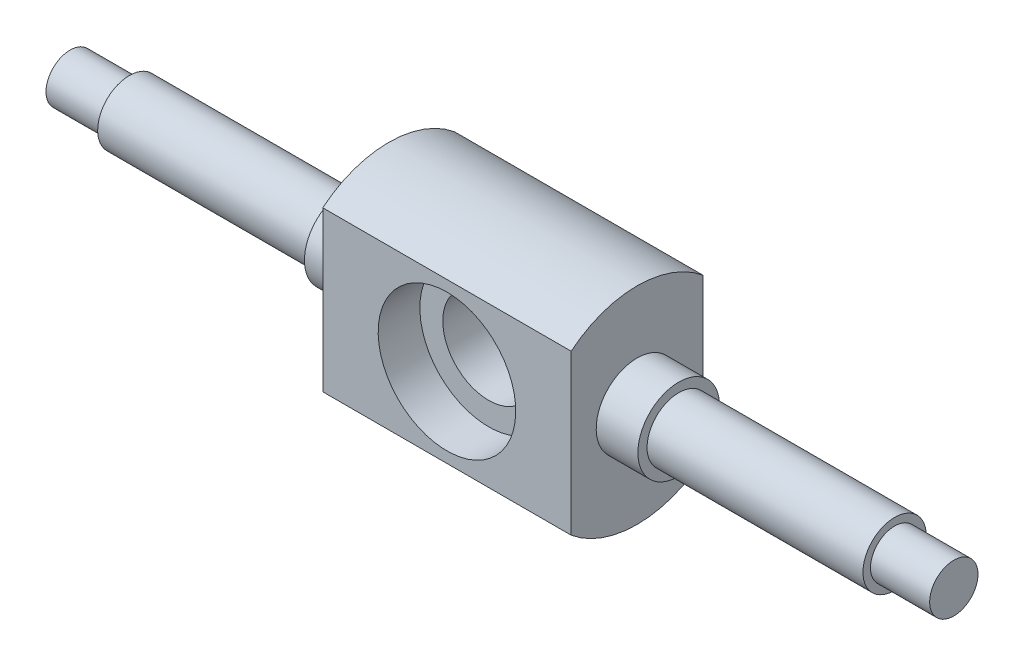
ISO-10303-21;
HEADER;
FILE_DESCRIPTION(('STEP AP214'),'2;1');
FILE_NAME('part.step','',(''),(''),'','','');
FILE_SCHEMA(('AUTOMOTIVE_DESIGN { 1 0 10303 214 1 1 1 1 }'));
ENDSEC;
DATA;
#1=APPLICATION_CONTEXT('core data for automotive mechanical design processes');
#2=APPLICATION_PROTOCOL_DEFINITION('international standard','automotive_design',2000,#1);
#3=PRODUCT_CONTEXT('',#1,'mechanical');
#4=PRODUCT('Part','Part','',(#3));
#5=PRODUCT_RELATED_PRODUCT_CATEGORY('part','',(#4));
#6=PRODUCT_DEFINITION_FORMATION('','',#4);
#7=PRODUCT_DEFINITION_CONTEXT('part definition',#1,'design');
#8=PRODUCT_DEFINITION('design','',#6,#7);
#9=PRODUCT_DEFINITION_SHAPE('','',#8);
#10=(LENGTH_UNIT() NAMED_UNIT(*) SI_UNIT(.MILLI.,.METRE.));
#11=(NAMED_UNIT(*) PLANE_ANGLE_UNIT() SI_UNIT($,.RADIAN.));
#12=(NAMED_UNIT(*) SI_UNIT($,.STERADIAN.) SOLID_ANGLE_UNIT());
#13=UNCERTAINTY_MEASURE_WITH_UNIT(LENGTH_MEASURE(1.E-05),#10,'distance_accuracy_value','');
#14=(GEOMETRIC_REPRESENTATION_CONTEXT(3) GLOBAL_UNCERTAINTY_ASSIGNED_CONTEXT((#13)) GLOBAL_UNIT_ASSIGNED_CONTEXT((#10,
#11,#12)) REPRESENTATION_CONTEXT('',''));
#15=CARTESIAN_POINT('',(0.,0.,0.));
#16=DIRECTION('',(0.,0.,1.));
#17=DIRECTION('',(1.,0.,0.));
#18=AXIS2_PLACEMENT_3D('',#15,#16,#17);
#19=CARTESIAN_POINT('',(7.09966666666639,2.90000004470337,7.8999999999998));
#20=DIRECTION('',(-1.,0.,0.));
#21=DIRECTION('',(0.,-1.,0.));
#22=AXIS2_PLACEMENT_3D('',#19,#20,#21);
#23=PLANE('',#22);
#24=CARTESIAN_POINT('',(7.09966666666639,2.90000004470337,7.8999999999998));
#25=DIRECTION('',(1.,0.,0.));
#26=DIRECTION('',(0.,1.,0.));
#27=AXIS2_PLACEMENT_3D('',#24,#25,#26);
#28=CIRCLE('',#27,3.8);
#29=CARTESIAN_POINT('',(7.09966666666639,6.70000004470339,7.89999999999991));
#30=VERTEX_POINT('',#29);
#31=EDGE_CURVE('E20',#30,#30,#28,.T.);
#32=ORIENTED_EDGE('',*,*,#31,.F.);
#33=EDGE_LOOP('',(#32));
#34=FACE_BOUND('',#33,.T.);
#35=CARTESIAN_POINT('',(7.09966666666639,2.90000004470337,7.8999999999998));
#36=DIRECTION('',(-1.,0.,0.));
#37=DIRECTION('',(0.,-1.,0.));
#38=AXIS2_PLACEMENT_3D('',#35,#36,#37);
#39=CIRCLE('',#38,2.90000004470348);
#40=CARTESIAN_POINT('',(7.09966666666628,0.,7.8999999999998));
#41=VERTEX_POINT('',#40);
#42=EDGE_CURVE('E10',#41,#41,#39,.T.);
#43=ORIENTED_EDGE('',*,*,#42,.F.);
#44=EDGE_LOOP('',(#43));
#45=FACE_BOUND('',#44,.T.);
#46=ADVANCED_FACE('F16',(#34,#45),#23,.T.);
#47=CARTESIAN_POINT('',(106.,2.90000004470337,7.8999999999998));
#48=DIRECTION('',(-1.,0.,0.));
#49=DIRECTION('',(0.,-1.,0.));
#50=AXIS2_PLACEMENT_3D('',#47,#48,#49);
#51=CYLINDRICAL_SURFACE('',#50,2.90000004470348);
#52=ORIENTED_EDGE('',*,*,#42,.T.);
#53=EDGE_LOOP('',(#52));
#54=FACE_BOUND('',#53,.T.);
#55=CARTESIAN_POINT('',(-3.33066907387547E-13,2.90000004470337,7.8999999999998));
#56=DIRECTION('',(-1.,0.,0.));
#57=DIRECTION('',(0.,-1.,0.));
#58=AXIS2_PLACEMENT_3D('',#55,#56,#57);
#59=CIRCLE('',#58,2.90000004470348);
#60=CARTESIAN_POINT('',(-3.33066907387547E-13,0.,7.8999999999998));
#61=VERTEX_POINT('',#60);
#62=EDGE_CURVE('E143',#61,#61,#59,.T.);
#63=ORIENTED_EDGE('',*,*,#62,.F.);
#64=EDGE_LOOP('',(#63));
#65=FACE_BOUND('',#64,.T.);
#66=ADVANCED_FACE('F385',(#54,#65),#51,.T.);
#67=CARTESIAN_POINT('',(106.,2.90000004470337,7.8999999999998));
#68=DIRECTION('',(-1.,0.,0.));
#69=DIRECTION('',(0.,-1.,0.));
#70=AXIS2_PLACEMENT_3D('',#67,#68,#69);
#71=CYLINDRICAL_SURFACE('',#70,2.90000004470348);
#72=CARTESIAN_POINT('',(106.,2.90000004470337,7.8999999999998));
#73=DIRECTION('',(-1.,0.,0.));
#74=DIRECTION('',(0.,-1.,0.));
#75=AXIS2_PLACEMENT_3D('',#72,#73,#74);
#76=CIRCLE('',#75,2.90000004470348);
#77=CARTESIAN_POINT('',(106.,-1.11022302462516E-13,7.8999999999998));
#78=VERTEX_POINT('',#77);
#79=EDGE_CURVE('E133',#78,#78,#76,.T.);
#80=ORIENTED_EDGE('',*,*,#79,.T.);
#81=EDGE_LOOP('',(#80));
#82=FACE_BOUND('',#81,.T.);
#83=CARTESIAN_POINT('',(98.8999999999996,2.90000004470337,7.8999999999998));
#84=DIRECTION('',(1.,0.,0.));
#85=DIRECTION('',(0.,-1.,0.));
#86=AXIS2_PLACEMENT_3D('',#83,#84,#85);
#87=CIRCLE('',#86,2.90000004470348);
#88=CARTESIAN_POINT('',(98.8999999999997,-1.11022302462516E-13,7.89999999999991));
#89=VERTEX_POINT('',#88);
#90=EDGE_CURVE('E27',#89,#89,#87,.T.);
#91=ORIENTED_EDGE('',*,*,#90,.T.);
#92=EDGE_LOOP('',(#91));
#93=FACE_BOUND('',#92,.T.);
#94=ADVANCED_FACE('F379',(#82,#93),#71,.T.);
#95=CARTESIAN_POINT('',(98.8999999999996,2.90000004470337,7.8999999999998));
#96=DIRECTION('',(1.,0.,0.));
#97=DIRECTION('',(0.,0.,1.));
#98=AXIS2_PLACEMENT_3D('',#95,#96,#97);
#99=PLANE('',#98);
#100=CARTESIAN_POINT('',(98.8999999999996,2.90000004470337,7.8999999999998));
#101=DIRECTION('',(-1.,0.,0.));
#102=DIRECTION('',(0.,-1.,0.));
#103=AXIS2_PLACEMENT_3D('',#100,#101,#102);
#104=CIRCLE('',#103,3.8);
#105=CARTESIAN_POINT('',(98.8999999999997,-0.899999955296549,7.89999999999991));
#106=VERTEX_POINT('',#105);
#107=EDGE_CURVE('E182',#106,#106,#104,.T.);
#108=ORIENTED_EDGE('',*,*,#107,.F.);
#109=EDGE_LOOP('',(#108));
#110=FACE_BOUND('',#109,.T.);
#111=ORIENTED_EDGE('',*,*,#90,.F.);
#112=EDGE_LOOP('',(#111));
#113=FACE_BOUND('',#112,.T.);
#114=ADVANCED_FACE('F384',(#110,#113),#99,.T.);
#115=CARTESIAN_POINT('',(-3.33066907387547E-13,2.90000004470337,7.8999999999998));
#116=DIRECTION('',(-1.,0.,0.));
#117=DIRECTION('',(0.,0.,1.));
#118=AXIS2_PLACEMENT_3D('',#115,#116,#117);
#119=PLANE('',#118);
#120=ORIENTED_EDGE('',*,*,#62,.T.);
#121=EDGE_LOOP('',(#120));
#122=FACE_BOUND('',#121,.T.);
#123=ADVANCED_FACE('F409',(#122),#119,.T.);
#124=CARTESIAN_POINT('',(32.9999999999996,2.90000004470337,7.8999999999998));
#125=DIRECTION('',(-1.,0.,0.));
#126=DIRECTION('',(0.,0.,1.));
#127=AXIS2_PLACEMENT_3D('',#124,#125,#126);
#128=PLANE('',#127);
#129=CARTESIAN_POINT('',(32.9999999999996,2.90000004470337,7.8999999999998));
#130=DIRECTION('',(-1.,0.,0.));
#131=DIRECTION('',(0.,0.,-1.));
#132=AXIS2_PLACEMENT_3D('',#129,#130,#131);
#133=CIRCLE('',#132,4.90000007450581);
#134=CARTESIAN_POINT('',(32.9999999999996,2.90000004470337,2.99999992549416));
#135=VERTEX_POINT('',#134);
#136=EDGE_CURVE('E68',#135,#135,#133,.T.);
#137=ORIENTED_EDGE('',*,*,#136,.T.);
#138=EDGE_LOOP('',(#137));
#139=FACE_BOUND('',#138,.T.);
#140=CARTESIAN_POINT('',(32.9999999999996,2.90000004470337,7.8999999999998));
#141=DIRECTION('',(-1.,0.,0.));
#142=DIRECTION('',(0.,0.,-1.));
#143=AXIS2_PLACEMENT_3D('',#140,#141,#142);
#144=CIRCLE('',#143,3.8);
#145=CARTESIAN_POINT('',(32.9999999999996,2.90000004470337,4.09999999999977));
#146=VERTEX_POINT('',#145);
#147=EDGE_CURVE('E180',#146,#146,#144,.T.);
#148=ORIENTED_EDGE('',*,*,#147,.F.);
#149=EDGE_LOOP('',(#148));
#150=FACE_BOUND('',#149,.T.);
#151=ADVANCED_FACE('F414',(#139,#150),#128,.T.);
#152=CARTESIAN_POINT('',(53.0969995708462,2.90000004470337,10.7999999999999));
#153=DIRECTION('',(0.,0.,1.));
#154=DIRECTION('',(0.,1.,0.));
#155=AXIS2_PLACEMENT_3D('',#152,#153,#154);
#156=PLANE('',#155);
#157=CARTESIAN_POINT('',(53.0969995708461,2.90000004470392,10.7999999999999));
#158=DIRECTION('',(0.,0.,-1.));
#159=DIRECTION('',(0.,1.,0.));
#160=AXIS2_PLACEMENT_3D('',#157,#158,#159);
#161=CIRCLE('',#160,8.25);
#162=CARTESIAN_POINT('',(53.0969995708461,11.1500000447039,10.7999999999999));
#163=VERTEX_POINT('',#162);
#164=EDGE_CURVE('E144',#163,#163,#161,.T.);
#165=ORIENTED_EDGE('',*,*,#164,.F.);
#166=EDGE_LOOP('',(#165));
#167=FACE_BOUND('',#166,.T.);
#168=CARTESIAN_POINT('',(53.0969995708461,2.90000004470392,10.7999999999999));
#169=DIRECTION('',(0.,0.,1.));
#170=DIRECTION('',(0.,-1.,0.));
#171=AXIS2_PLACEMENT_3D('',#168,#169,#170);
#172=CIRCLE('',#171,5.50000005960464);
#173=CARTESIAN_POINT('',(53.0969995708461,-2.60000001490079,10.7999999999999));
#174=VERTEX_POINT('',#173);
#175=EDGE_CURVE('E115',#174,#174,#172,.T.);
#176=ORIENTED_EDGE('',*,*,#175,.F.);
#177=EDGE_LOOP('',(#176));
#178=FACE_BOUND('',#177,.T.);
#179=ADVANCED_FACE('F474',(#167,#178),#156,.T.);
#180=CARTESIAN_POINT('',(53.0969995708461,2.90000004470392,4.99999999999989));
#181=DIRECTION('',(0.,0.,-1.));
#182=DIRECTION('',(1.,0.,0.));
#183=AXIS2_PLACEMENT_3D('',#180,#181,#182);
#184=PLANE('',#183);
#185=CARTESIAN_POINT('',(53.0969995708461,2.90000004470392,4.99999999999989));
#186=DIRECTION('',(0.,0.,1.));
#187=DIRECTION('',(1.,0.,0.));
#188=AXIS2_PLACEMENT_3D('',#185,#186,#187);
#189=CIRCLE('',#188,8.25);
#190=CARTESIAN_POINT('',(61.3469995708461,2.90000004470392,4.99999999999989));
#191=VERTEX_POINT('',#190);
#192=EDGE_CURVE('E170',#191,#191,#189,.T.);
#193=ORIENTED_EDGE('',*,*,#192,.F.);
#194=EDGE_LOOP('',(#193));
#195=FACE_BOUND('',#194,.T.);
#196=CARTESIAN_POINT('',(53.0969995708461,2.90000004470392,4.99999999999989));
#197=DIRECTION('',(0.,0.,-1.));
#198=DIRECTION('',(0.,-1.,0.));
#199=AXIS2_PLACEMENT_3D('',#196,#197,#198);
#200=CIRCLE('',#199,5.50000005960464);
#201=CARTESIAN_POINT('',(53.0969995708462,-2.60000001490079,4.99999999999989));
#202=VERTEX_POINT('',#201);
#203=EDGE_CURVE('E123',#202,#202,#200,.T.);
#204=ORIENTED_EDGE('',*,*,#203,.F.);
#205=EDGE_LOOP('',(#204));
#206=FACE_BOUND('',#205,.T.);
#207=ADVANCED_FACE('F444',(#195,#206),#184,.T.);
#208=CARTESIAN_POINT('',(53.0969995708461,2.90000004470392,15.7999999999998));
#209=DIRECTION('',(0.,0.,1.));
#210=DIRECTION('',(0.,1.,0.));
#211=AXIS2_PLACEMENT_3D('',#208,#209,#210);
#212=CYLINDRICAL_SURFACE('',#211,8.25);
#213=CARTESIAN_POINT('',(53.0969995708461,2.90000004470392,15.7999999999998));
#214=DIRECTION('',(0.,0.,-1.));
#215=DIRECTION('',(0.,1.,0.));
#216=AXIS2_PLACEMENT_3D('',#213,#214,#215);
#217=CIRCLE('',#216,8.25);
#218=CARTESIAN_POINT('',(53.0969995708462,11.1500000447039,15.7999999999998));
#219=VERTEX_POINT('',#218);
#220=EDGE_CURVE('E148',#219,#219,#217,.T.);
#221=ORIENTED_EDGE('',*,*,#220,.F.);
#222=EDGE_LOOP('',(#221));
#223=FACE_BOUND('',#222,.T.);
#224=ORIENTED_EDGE('',*,*,#164,.T.);
#225=EDGE_LOOP('',(#224));
#226=FACE_BOUND('',#225,.T.);
#227=ADVANCED_FACE('F439',(#223,#226),#212,.F.);
#228=CARTESIAN_POINT('',(53.0999988853926,2.90000004470337,15.7999999999998));
#229=DIRECTION('',(0.,0.,-1.));
#230=DIRECTION('',(1.,0.,0.));
#231=AXIS2_PLACEMENT_3D('',#228,#229,#230);
#232=PLANE('',#231);
#233=DIRECTION('',(0.,-1.,0.));
#234=VECTOR('',#233,1.);
#235=CARTESIAN_POINT('',(67.9999999999997,2.90000004470337,15.7999999999998));
#236=LINE('',#235,#234);
#237=CARTESIAN_POINT('',(67.9999999999996,12.4577194379479,15.7999999999998));
#238=VERTEX_POINT('',#237);
#239=CARTESIAN_POINT('',(67.9999999999997,-6.65771934854109,15.7999999999998));
#240=VERTEX_POINT('',#239);
#241=EDGE_CURVE('E185',#238,#240,#236,.T.);
#242=ORIENTED_EDGE('',*,*,#241,.F.);
#243=DIRECTION('',(1.,0.,0.));
#244=VECTOR('',#243,1.);
#245=CARTESIAN_POINT('',(73.0999999999996,12.4577194379479,15.7999999999998));
#246=LINE('',#245,#244);
#247=CARTESIAN_POINT('',(38.1999999999997,12.4577194379479,15.7999999999999));
#248=VERTEX_POINT('',#247);
#249=EDGE_CURVE('E174',#248,#238,#246,.T.);
#250=ORIENTED_EDGE('',*,*,#249,.F.);
#251=DIRECTION('',(0.,1.,0.));
#252=VECTOR('',#251,1.);
#253=CARTESIAN_POINT('',(38.1999999999997,2.90000004470337,15.7999999999998));
#254=LINE('',#253,#252);
#255=CARTESIAN_POINT('',(38.1999999999997,-6.65771934854098,15.7999999999998));
#256=VERTEX_POINT('',#255);
#257=EDGE_CURVE('E157',#256,#248,#254,.T.);
#258=ORIENTED_EDGE('',*,*,#257,.F.);
#259=DIRECTION('',(-1.,0.,0.));
#260=VECTOR('',#259,1.);
#261=CARTESIAN_POINT('',(73.0999999999996,-6.65771934854109,15.7999999999998));
#262=LINE('',#261,#260);
#263=EDGE_CURVE('E134',#240,#256,#262,.T.);
#264=ORIENTED_EDGE('',*,*,#263,.F.);
#265=EDGE_LOOP('',(#242,#250,#258,#264));
#266=FACE_BOUND('',#265,.T.);
#267=ORIENTED_EDGE('',*,*,#220,.T.);
#268=EDGE_LOOP('',(#267));
#269=FACE_BOUND('',#268,.T.);
#270=ADVANCED_FACE('F226',(#266,#269),#232,.F.);
#271=CARTESIAN_POINT('',(38.1999999999997,2.90000004470337,7.8999999999998));
#272=DIRECTION('',(-1.,0.,0.));
#273=DIRECTION('',(0.,0.,1.));
#274=AXIS2_PLACEMENT_3D('',#271,#272,#273);
#275=PLANE('',#274);
#276=ORIENTED_EDGE('',*,*,#257,.T.);
#277=CARTESIAN_POINT('',(38.1999999999997,2.90000004470337,7.8999999999998));
#278=DIRECTION('',(1.,0.,0.));
#279=DIRECTION('',(0.,0.693974062915902,0.72));
#280=AXIS2_PLACEMENT_3D('',#277,#278,#279);
#281=CIRCLE('',#280,12.4);
#282=CARTESIAN_POINT('',(38.1999999999997,12.4577194379479,-1.11022302462516E-13));
#283=VERTEX_POINT('',#282);
#284=EDGE_CURVE('E160',#283,#248,#281,.T.);
#285=ORIENTED_EDGE('',*,*,#284,.F.);
#286=DIRECTION('',(0.,-1.,0.));
#287=VECTOR('',#286,1.);
#288=CARTESIAN_POINT('',(38.1999999999996,2.90000004470337,-2.22044604925031E-13));
#289=LINE('',#288,#287);
#290=CARTESIAN_POINT('',(38.1999999999996,-6.65771934854109,-2.22044604925031E-13));
#291=VERTEX_POINT('',#290);
#292=EDGE_CURVE('E189',#283,#291,#289,.T.);
#293=ORIENTED_EDGE('',*,*,#292,.T.);
#294=CARTESIAN_POINT('',(38.1999999999997,2.90000004470337,7.8999999999998));
#295=DIRECTION('',(-1.,0.,0.));
#296=DIRECTION('',(0.,0.,-1.));
#297=AXIS2_PLACEMENT_3D('',#294,#295,#296);
#298=CIRCLE('',#297,12.4);
#299=EDGE_CURVE('E138',#291,#256,#298,.T.);
#300=ORIENTED_EDGE('',*,*,#299,.T.);
#301=EDGE_LOOP('',(#276,#285,#293,#300));
#302=FACE_BOUND('',#301,.T.);
#303=CARTESIAN_POINT('',(38.1999999999997,2.90000004470337,7.8999999999998));
#304=DIRECTION('',(1.,0.,0.));
#305=DIRECTION('',(0.,0.,-1.));
#306=AXIS2_PLACEMENT_3D('',#303,#304,#305);
#307=CIRCLE('',#306,4.90000007450581);
#308=CARTESIAN_POINT('',(38.1999999999997,2.90000004470348,2.99999992549393));
#309=VERTEX_POINT('',#308);
#310=EDGE_CURVE('E81',#309,#309,#307,.T.);
#311=ORIENTED_EDGE('',*,*,#310,.T.);
#312=EDGE_LOOP('',(#311));
#313=FACE_BOUND('',#312,.T.);
#314=ADVANCED_FACE('F368',(#302,#313),#275,.T.);
#315=CARTESIAN_POINT('',(73.0999999999996,2.90000004470348,7.8999999999998));
#316=DIRECTION('',(-1.,0.,0.));
#317=DIRECTION('',(0.,0.693974062915902,0.72));
#318=AXIS2_PLACEMENT_3D('',#315,#316,#317);
#319=CYLINDRICAL_SURFACE('',#318,12.4);
#320=ORIENTED_EDGE('',*,*,#249,.T.);
#321=CARTESIAN_POINT('',(67.9999999999997,2.90000004470337,7.89999999999991));
#322=DIRECTION('',(1.,0.,0.));
#323=DIRECTION('',(0.,0.693974062915902,0.72));
#324=AXIS2_PLACEMENT_3D('',#321,#322,#323);
#325=CIRCLE('',#324,12.4);
#326=CARTESIAN_POINT('',(67.9999999999997,12.4577194379479,-2.22044604925031E-13));
#327=VERTEX_POINT('',#326);
#328=EDGE_CURVE('E151',#327,#238,#325,.T.);
#329=ORIENTED_EDGE('',*,*,#328,.F.);
#330=DIRECTION('',(-1.,0.,0.));
#331=VECTOR('',#330,1.);
#332=CARTESIAN_POINT('',(73.0999999999996,12.4577194379479,-1.11022302462516E-13));
#333=LINE('',#332,#331);
#334=EDGE_CURVE('E175',#327,#283,#333,.T.);
#335=ORIENTED_EDGE('',*,*,#334,.T.);
#336=ORIENTED_EDGE('',*,*,#284,.T.);
#337=EDGE_LOOP('',(#320,#329,#335,#336));
#338=FACE_BOUND('',#337,.T.);
#339=ADVANCED_FACE('F213',(#338),#319,.T.);
#340=CARTESIAN_POINT('',(53.0969995708461,2.90000004470392,15.7999999999998));
#341=DIRECTION('',(0.,0.,1.));
#342=DIRECTION('',(0.,1.,0.));
#343=AXIS2_PLACEMENT_3D('',#340,#341,#342);
#344=CYLINDRICAL_SURFACE('',#343,8.25);
#345=CARTESIAN_POINT('',(53.0969995708461,2.90000004470392,0.));
#346=DIRECTION('',(0.,0.,1.));
#347=DIRECTION('',(1.,0.,0.));
#348=AXIS2_PLACEMENT_3D('',#345,#346,#347);
#349=CIRCLE('',#348,8.25);
#350=CARTESIAN_POINT('',(61.3469995708461,2.90000004470392,-1.11022302462516E-13));
#351=VERTEX_POINT('',#350);
#352=EDGE_CURVE('E155',#351,#351,#349,.T.);
#353=ORIENTED_EDGE('',*,*,#352,.F.);
#354=EDGE_LOOP('',(#353));
#355=FACE_BOUND('',#354,.T.);
#356=ORIENTED_EDGE('',*,*,#192,.T.);
#357=EDGE_LOOP('',(#356));
#358=FACE_BOUND('',#357,.T.);
#359=ADVANCED_FACE('F392',(#355,#358),#344,.F.);
#360=CARTESIAN_POINT('',(53.0999988853927,2.90000004470337,-1.11022302462516E-13));
#361=DIRECTION('',(0.,0.,-1.));
#362=DIRECTION('',(1.,0.,0.));
#363=AXIS2_PLACEMENT_3D('',#360,#361,#362);
#364=PLANE('',#363);
#365=ORIENTED_EDGE('',*,*,#292,.F.);
#366=ORIENTED_EDGE('',*,*,#334,.F.);
#367=DIRECTION('',(0.,1.,0.));
#368=VECTOR('',#367,1.);
#369=CARTESIAN_POINT('',(67.9999999999997,2.90000004470337,-2.22044604925031E-13));
#370=LINE('',#369,#368);
#371=CARTESIAN_POINT('',(67.9999999999996,-6.6577193485412,-2.22044604925031E-13));
#372=VERTEX_POINT('',#371);
#373=EDGE_CURVE('E156',#372,#327,#370,.T.);
#374=ORIENTED_EDGE('',*,*,#373,.F.);
#375=DIRECTION('',(1.,0.,0.));
#376=VECTOR('',#375,1.);
#377=CARTESIAN_POINT('',(73.0999999999996,-6.65771934854109,-1.11022302462516E-13));
#378=LINE('',#377,#376);
#379=EDGE_CURVE('E161',#291,#372,#378,.T.);
#380=ORIENTED_EDGE('',*,*,#379,.F.);
#381=EDGE_LOOP('',(#365,#366,#374,#380));
#382=FACE_BOUND('',#381,.T.);
#383=ORIENTED_EDGE('',*,*,#352,.T.);
#384=EDGE_LOOP('',(#383));
#385=FACE_BOUND('',#384,.T.);
#386=ADVANCED_FACE('F256',(#382,#385),#364,.T.);
#387=CARTESIAN_POINT('',(67.9999999999997,2.90000004470337,7.89999999999991));
#388=DIRECTION('',(-1.,0.,0.));
#389=DIRECTION('',(0.,0.,1.));
#390=AXIS2_PLACEMENT_3D('',#387,#388,#389);
#391=PLANE('',#390);
#392=ORIENTED_EDGE('',*,*,#241,.T.);
#393=CARTESIAN_POINT('',(67.9999999999997,2.90000004470337,7.89999999999991));
#394=DIRECTION('',(-1.,0.,0.));
#395=DIRECTION('',(0.,0.,-1.));
#396=AXIS2_PLACEMENT_3D('',#393,#394,#395);
#397=CIRCLE('',#396,12.4);
#398=EDGE_CURVE('E129',#372,#240,#397,.T.);
#399=ORIENTED_EDGE('',*,*,#398,.F.);
#400=ORIENTED_EDGE('',*,*,#373,.T.);
#401=ORIENTED_EDGE('',*,*,#328,.T.);
#402=EDGE_LOOP('',(#392,#399,#400,#401));
#403=FACE_BOUND('',#402,.T.);
#404=CARTESIAN_POINT('',(67.9999999999997,2.90000004470337,7.89999999999991));
#405=DIRECTION('',(1.,0.,0.));
#406=DIRECTION('',(0.,1.,0.));
#407=AXIS2_PLACEMENT_3D('',#404,#405,#406);
#408=CIRCLE('',#407,4.90000007450581);
#409=CARTESIAN_POINT('',(67.9999999999997,7.80000011920923,7.89999999999991));
#410=VERTEX_POINT('',#409);
#411=EDGE_CURVE('E111',#410,#410,#408,.T.);
#412=ORIENTED_EDGE('',*,*,#411,.F.);
#413=EDGE_LOOP('',(#412));
#414=FACE_BOUND('',#413,.T.);
#415=ADVANCED_FACE('F221',(#403,#414),#391,.F.);
#416=CARTESIAN_POINT('',(106.,2.90000004470337,7.8999999999998));
#417=DIRECTION('',(-1.,0.,0.));
#418=DIRECTION('',(0.,-1.,0.));
#419=AXIS2_PLACEMENT_3D('',#416,#417,#418);
#420=CYLINDRICAL_SURFACE('',#419,3.8);
#421=ORIENTED_EDGE('',*,*,#107,.T.);
#422=EDGE_LOOP('',(#421));
#423=FACE_BOUND('',#422,.T.);
#424=CARTESIAN_POINT('',(72.9999999999996,2.90000004470337,7.89999999999991));
#425=DIRECTION('',(1.,0.,0.));
#426=DIRECTION('',(0.,-1.,0.));
#427=AXIS2_PLACEMENT_3D('',#424,#425,#426);
#428=CIRCLE('',#427,3.8);
#429=CARTESIAN_POINT('',(72.9999999999996,-0.899999955296549,7.8999999999998));
#430=VERTEX_POINT('',#429);
#431=EDGE_CURVE('E125',#430,#430,#428,.T.);
#432=ORIENTED_EDGE('',*,*,#431,.T.);
#433=EDGE_LOOP('',(#432));
#434=FACE_BOUND('',#433,.T.);
#435=ADVANCED_FACE('F354',(#423,#434),#420,.T.);
#436=CARTESIAN_POINT('',(106.,2.90000004470337,7.8999999999998));
#437=DIRECTION('',(-1.,0.,0.));
#438=DIRECTION('',(0.,-1.,0.));
#439=AXIS2_PLACEMENT_3D('',#436,#437,#438);
#440=CYLINDRICAL_SURFACE('',#439,3.8);
#441=ORIENTED_EDGE('',*,*,#31,.T.);
#442=EDGE_LOOP('',(#441));
#443=FACE_BOUND('',#442,.T.);
#444=ORIENTED_EDGE('',*,*,#147,.T.);
#445=EDGE_LOOP('',(#444));
#446=FACE_BOUND('',#445,.T.);
#447=ADVANCED_FACE('F345',(#443,#446),#440,.T.);
#448=CARTESIAN_POINT('',(53.0969995708461,2.90000004470392,-1.1000000000001));
#449=DIRECTION('',(0.,0.,1.));
#450=DIRECTION('',(0.,-1.,0.));
#451=AXIS2_PLACEMENT_3D('',#448,#449,#450);
#452=CYLINDRICAL_SURFACE('',#451,5.50000005960464);
#453=ORIENTED_EDGE('',*,*,#203,.T.);
#454=EDGE_LOOP('',(#453));
#455=FACE_BOUND('',#454,.T.);
#456=ORIENTED_EDGE('',*,*,#175,.T.);
#457=EDGE_LOOP('',(#456));
#458=FACE_BOUND('',#457,.T.);
#459=ADVANCED_FACE('F340',(#455,#458),#452,.F.);
#460=CARTESIAN_POINT('',(38.0999999999996,2.90000004470337,7.8999999999998));
#461=DIRECTION('',(1.,0.,0.));
#462=DIRECTION('',(0.,1.,0.));
#463=AXIS2_PLACEMENT_3D('',#460,#461,#462);
#464=CYLINDRICAL_SURFACE('',#463,4.90000007450581);
#465=CARTESIAN_POINT('',(72.9999999999996,2.90000004470337,7.89999999999991));
#466=DIRECTION('',(1.,0.,0.));
#467=DIRECTION('',(0.,1.,0.));
#468=AXIS2_PLACEMENT_3D('',#465,#466,#467);
#469=CIRCLE('',#468,4.90000007450581);
#470=CARTESIAN_POINT('',(72.9999999999996,7.80000011920923,7.89999999999991));
#471=VERTEX_POINT('',#470);
#472=EDGE_CURVE('E116',#471,#471,#469,.T.);
#473=ORIENTED_EDGE('',*,*,#472,.F.);
#474=EDGE_LOOP('',(#473));
#475=FACE_BOUND('',#474,.T.);
#476=ORIENTED_EDGE('',*,*,#411,.T.);
#477=EDGE_LOOP('',(#476));
#478=FACE_BOUND('',#477,.T.);
#479=ADVANCED_FACE('F112',(#475,#478),#464,.T.);
#480=CARTESIAN_POINT('',(72.9999999999996,2.90000004470337,7.89999999999991));
#481=DIRECTION('',(-1.,0.,0.));
#482=DIRECTION('',(0.,0.,1.));
#483=AXIS2_PLACEMENT_3D('',#480,#481,#482);
#484=PLANE('',#483);
#485=ORIENTED_EDGE('',*,*,#472,.T.);
#486=EDGE_LOOP('',(#485));
#487=FACE_BOUND('',#486,.T.);
#488=ORIENTED_EDGE('',*,*,#431,.F.);
#489=EDGE_LOOP('',(#488));
#490=FACE_BOUND('',#489,.T.);
#491=ADVANCED_FACE('F328',(#487,#490),#484,.F.);
#492=CARTESIAN_POINT('',(38.0999999999996,2.90000004470337,7.8999999999998));
#493=DIRECTION('',(1.,0.,0.));
#494=DIRECTION('',(0.,1.,0.));
#495=AXIS2_PLACEMENT_3D('',#492,#493,#494);
#496=CYLINDRICAL_SURFACE('',#495,4.90000007450581);
#497=ORIENTED_EDGE('',*,*,#136,.F.);
#498=EDGE_LOOP('',(#497));
#499=FACE_BOUND('',#498,.T.);
#500=ORIENTED_EDGE('',*,*,#310,.F.);
#501=EDGE_LOOP('',(#500));
#502=FACE_BOUND('',#501,.T.);
#503=ADVANCED_FACE('F333',(#499,#502),#496,.T.);
#504=CARTESIAN_POINT('',(106.,2.90000004470337,7.8999999999998));
#505=DIRECTION('',(-1.,0.,0.));
#506=DIRECTION('',(0.,0.,1.));
#507=AXIS2_PLACEMENT_3D('',#504,#505,#506);
#508=PLANE('',#507);
#509=ORIENTED_EDGE('',*,*,#79,.F.);
#510=EDGE_LOOP('',(#509));
#511=FACE_BOUND('',#510,.T.);
#512=ADVANCED_FACE('F18',(#511),#508,.F.);
#513=CARTESIAN_POINT('',(73.0999999999996,2.90000004470348,7.8999999999998));
#514=DIRECTION('',(-1.,0.,0.));
#515=DIRECTION('',(0.,0.693974062915902,0.72));
#516=AXIS2_PLACEMENT_3D('',#513,#514,#515);
#517=CYLINDRICAL_SURFACE('',#516,12.4);
#518=ORIENTED_EDGE('',*,*,#263,.T.);
#519=ORIENTED_EDGE('',*,*,#299,.F.);
#520=ORIENTED_EDGE('',*,*,#379,.T.);
#521=ORIENTED_EDGE('',*,*,#398,.T.);
#522=EDGE_LOOP('',(#518,#519,#520,#521));
#523=FACE_BOUND('',#522,.T.);
#524=ADVANCED_FACE('F231',(#523),#517,.T.);
#525=CLOSED_SHELL('',(#46,#66,#94,#114,#123,#151,#179,#207,#227,#270,#314,#339,#359,#386,#415,
#435,#447,#459,#479,#491,#503,#512,#524));
#526=MANIFOLD_SOLID_BREP('B1',#525);
#527=ADVANCED_BREP_SHAPE_REPRESENTATION('',(#18,#526),#14);
#528=SHAPE_DEFINITION_REPRESENTATION(#9,#527);
ENDSEC;
END-ISO-10303-21;
